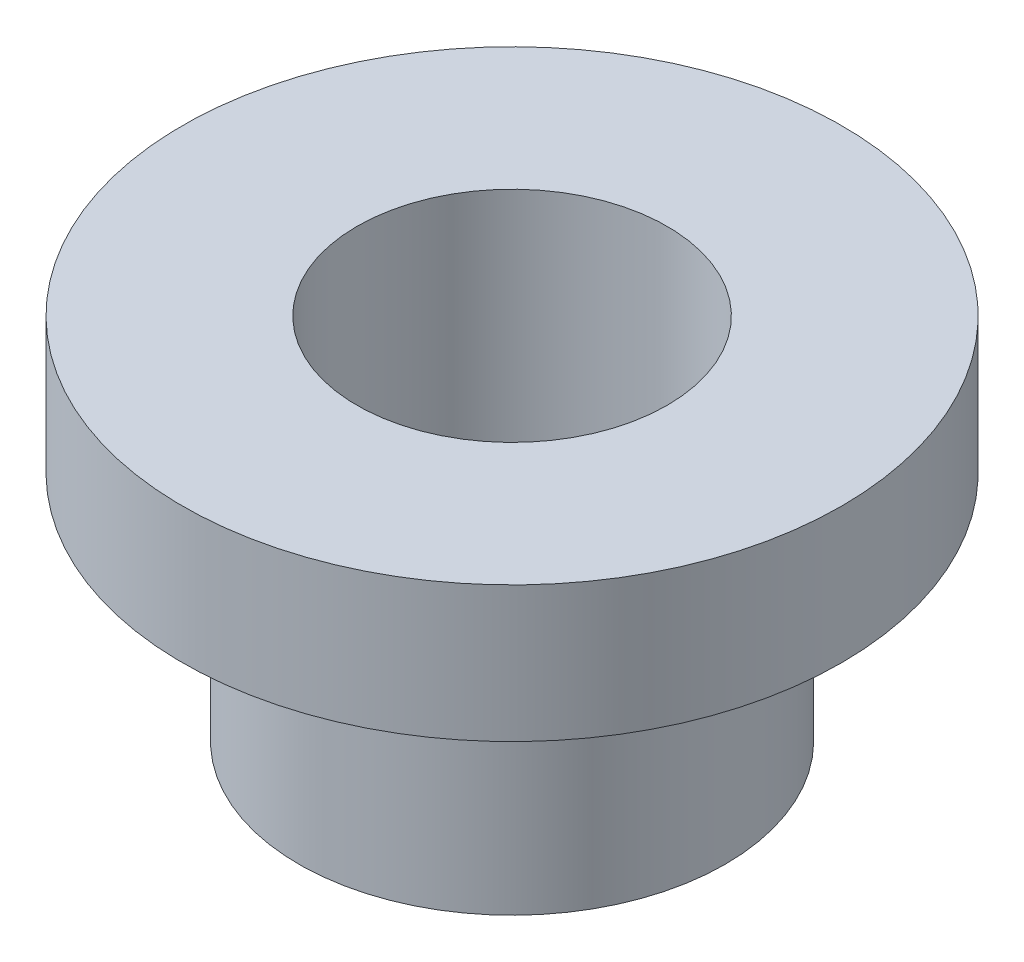
ISO-10303-21;
HEADER;
FILE_DESCRIPTION(('STEP AP214'),'2;1');
FILE_NAME('part.step','',(''),(''),'','','');
FILE_SCHEMA(('AUTOMOTIVE_DESIGN { 1 0 10303 214 1 1 1 1 }'));
ENDSEC;
DATA;
#1=APPLICATION_CONTEXT('core data for automotive mechanical design processes');
#2=APPLICATION_PROTOCOL_DEFINITION('international standard','automotive_design',2000,#1);
#3=PRODUCT_CONTEXT('',#1,'mechanical');
#4=PRODUCT('Part','Part','',(#3));
#5=PRODUCT_RELATED_PRODUCT_CATEGORY('part','',(#4));
#6=PRODUCT_DEFINITION_FORMATION('','',#4);
#7=PRODUCT_DEFINITION_CONTEXT('part definition',#1,'design');
#8=PRODUCT_DEFINITION('design','',#6,#7);
#9=PRODUCT_DEFINITION_SHAPE('','',#8);
#10=(LENGTH_UNIT() NAMED_UNIT(*) SI_UNIT(.MILLI.,.METRE.));
#11=(NAMED_UNIT(*) PLANE_ANGLE_UNIT() SI_UNIT($,.RADIAN.));
#12=(NAMED_UNIT(*) SI_UNIT($,.STERADIAN.) SOLID_ANGLE_UNIT());
#13=UNCERTAINTY_MEASURE_WITH_UNIT(LENGTH_MEASURE(1.E-05),#10,'distance_accuracy_value','');
#14=(GEOMETRIC_REPRESENTATION_CONTEXT(3) GLOBAL_UNCERTAINTY_ASSIGNED_CONTEXT((#13)) GLOBAL_UNIT_ASSIGNED_CONTEXT((#10,
#11,#12)) REPRESENTATION_CONTEXT('',''));
#15=CARTESIAN_POINT('',(0.,0.,0.));
#16=DIRECTION('',(0.,0.,1.));
#17=DIRECTION('',(1.,0.,0.));
#18=AXIS2_PLACEMENT_3D('',#15,#16,#17);
#19=CARTESIAN_POINT('',(0.,0.,0.));
#20=DIRECTION('',(0.,-1.,0.));
#21=DIRECTION('',(1.,0.,0.));
#22=AXIS2_PLACEMENT_3D('',#19,#20,#21);
#23=CYLINDRICAL_SURFACE('',#22,8.);
#24=CARTESIAN_POINT('',(0.,19.,0.));
#25=DIRECTION('',(0.,-1.,0.));
#26=DIRECTION('',(1.,0.,0.));
#27=AXIS2_PLACEMENT_3D('',#24,#25,#26);
#28=CIRCLE('',#27,8.);
#29=CARTESIAN_POINT('',(8.,19.,0.));
#30=VERTEX_POINT('',#29);
#31=EDGE_CURVE('E10',#30,#30,#28,.T.);
#32=ORIENTED_EDGE('',*,*,#31,.F.);
#33=EDGE_LOOP('',(#32));
#34=FACE_BOUND('',#33,.T.);
#35=CARTESIAN_POINT('',(0.,0.,0.));
#36=DIRECTION('',(0.,-1.,0.));
#37=DIRECTION('',(1.,0.,0.));
#38=AXIS2_PLACEMENT_3D('',#35,#36,#37);
#39=CIRCLE('',#38,8.);
#40=CARTESIAN_POINT('',(8.,0.,0.));
#41=VERTEX_POINT('',#40);
#42=EDGE_CURVE('E57',#41,#41,#39,.T.);
#43=ORIENTED_EDGE('',*,*,#42,.T.);
#44=EDGE_LOOP('',(#43));
#45=FACE_BOUND('',#44,.T.);
#46=ADVANCED_FACE('F35',(#34,#45),#23,.F.);
#47=CARTESIAN_POINT('',(-8.,19.,0.));
#48=DIRECTION('',(0.,-1.,0.));
#49=DIRECTION('',(1.,0.,0.));
#50=AXIS2_PLACEMENT_3D('',#47,#48,#49);
#51=PLANE('',#50);
#52=CARTESIAN_POINT('',(0.,19.,0.));
#53=DIRECTION('',(0.,-1.,0.));
#54=DIRECTION('',(1.,0.,0.));
#55=AXIS2_PLACEMENT_3D('',#52,#53,#54);
#56=CIRCLE('',#55,17.);
#57=CARTESIAN_POINT('',(17.,19.,0.));
#58=VERTEX_POINT('',#57);
#59=EDGE_CURVE('E41',#58,#58,#56,.T.);
#60=ORIENTED_EDGE('',*,*,#59,.F.);
#61=EDGE_LOOP('',(#60));
#62=FACE_BOUND('',#61,.T.);
#63=ORIENTED_EDGE('',*,*,#31,.T.);
#64=EDGE_LOOP('',(#63));
#65=FACE_BOUND('',#64,.T.);
#66=ADVANCED_FACE('F82',(#62,#65),#51,.F.);
#67=CARTESIAN_POINT('',(0.,0.,0.));
#68=DIRECTION('',(0.,-1.,0.));
#69=DIRECTION('',(1.,0.,0.));
#70=AXIS2_PLACEMENT_3D('',#67,#68,#69);
#71=CYLINDRICAL_SURFACE('',#70,17.);
#72=CARTESIAN_POINT('',(0.,12.,0.));
#73=DIRECTION('',(0.,-1.,0.));
#74=DIRECTION('',(1.,0.,0.));
#75=AXIS2_PLACEMENT_3D('',#72,#73,#74);
#76=CIRCLE('',#75,17.);
#77=CARTESIAN_POINT('',(17.,12.,0.));
#78=VERTEX_POINT('',#77);
#79=EDGE_CURVE('E45',#78,#78,#76,.T.);
#80=ORIENTED_EDGE('',*,*,#79,.F.);
#81=EDGE_LOOP('',(#80));
#82=FACE_BOUND('',#81,.T.);
#83=ORIENTED_EDGE('',*,*,#59,.T.);
#84=EDGE_LOOP('',(#83));
#85=FACE_BOUND('',#84,.T.);
#86=ADVANCED_FACE('F77',(#82,#85),#71,.T.);
#87=CARTESIAN_POINT('',(-17.,12.,0.));
#88=DIRECTION('',(0.,1.,0.));
#89=DIRECTION('',(-1.,0.,0.));
#90=AXIS2_PLACEMENT_3D('',#87,#88,#89);
#91=PLANE('',#90);
#92=CARTESIAN_POINT('',(0.,12.,0.));
#93=DIRECTION('',(0.,-1.,0.));
#94=DIRECTION('',(1.,0.,0.));
#95=AXIS2_PLACEMENT_3D('',#92,#93,#94);
#96=CIRCLE('',#95,11.);
#97=CARTESIAN_POINT('',(11.,12.,0.));
#98=VERTEX_POINT('',#97);
#99=EDGE_CURVE('E49',#98,#98,#96,.T.);
#100=ORIENTED_EDGE('',*,*,#99,.F.);
#101=EDGE_LOOP('',(#100));
#102=FACE_BOUND('',#101,.T.);
#103=ORIENTED_EDGE('',*,*,#79,.T.);
#104=EDGE_LOOP('',(#103));
#105=FACE_BOUND('',#104,.T.);
#106=ADVANCED_FACE('F71',(#102,#105),#91,.F.);
#107=CARTESIAN_POINT('',(0.,0.,0.));
#108=DIRECTION('',(0.,-1.,0.));
#109=DIRECTION('',(1.,0.,0.));
#110=AXIS2_PLACEMENT_3D('',#107,#108,#109);
#111=CYLINDRICAL_SURFACE('',#110,11.);
#112=CARTESIAN_POINT('',(0.,0.,0.));
#113=DIRECTION('',(0.,-1.,0.));
#114=DIRECTION('',(1.,0.,0.));
#115=AXIS2_PLACEMENT_3D('',#112,#113,#114);
#116=CIRCLE('',#115,11.);
#117=CARTESIAN_POINT('',(11.,0.,0.));
#118=VERTEX_POINT('',#117);
#119=EDGE_CURVE('E54',#118,#118,#116,.T.);
#120=ORIENTED_EDGE('',*,*,#119,.F.);
#121=EDGE_LOOP('',(#120));
#122=FACE_BOUND('',#121,.T.);
#123=ORIENTED_EDGE('',*,*,#99,.T.);
#124=EDGE_LOOP('',(#123));
#125=FACE_BOUND('',#124,.T.);
#126=ADVANCED_FACE('F65',(#122,#125),#111,.T.);
#127=CARTESIAN_POINT('',(-11.,0.,0.));
#128=DIRECTION('',(0.,1.,0.));
#129=DIRECTION('',(-1.,0.,0.));
#130=AXIS2_PLACEMENT_3D('',#127,#128,#129);
#131=PLANE('',#130);
#132=ORIENTED_EDGE('',*,*,#42,.F.);
#133=EDGE_LOOP('',(#132));
#134=FACE_BOUND('',#133,.T.);
#135=ORIENTED_EDGE('',*,*,#119,.T.);
#136=EDGE_LOOP('',(#135));
#137=FACE_BOUND('',#136,.T.);
#138=ADVANCED_FACE('F62',(#134,#137),#131,.F.);
#139=CLOSED_SHELL('',(#46,#66,#86,#106,#126,#138));
#140=MANIFOLD_SOLID_BREP('B2',#139);
#141=ADVANCED_BREP_SHAPE_REPRESENTATION('',(#18,#140),#14);
#142=SHAPE_DEFINITION_REPRESENTATION(#9,#141);
ENDSEC;
END-ISO-10303-21;
